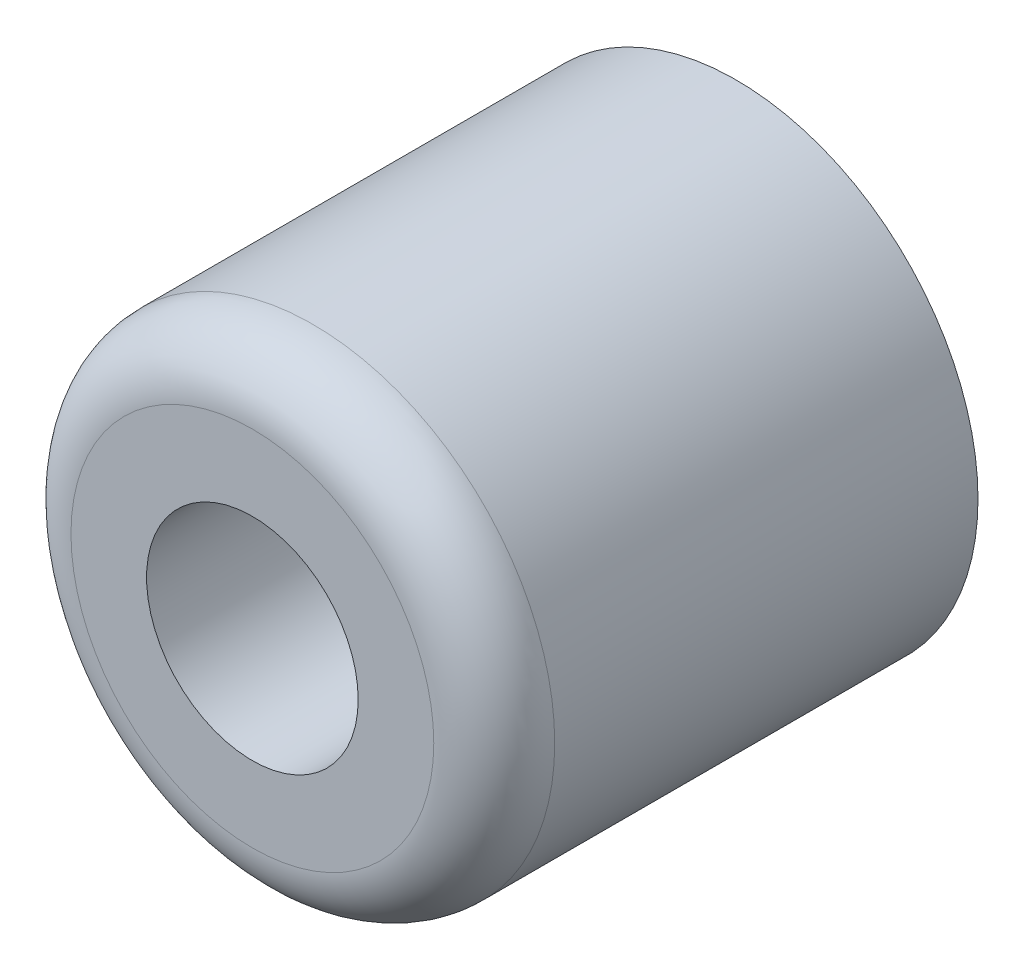
ISO-10303-21;
HEADER;
FILE_DESCRIPTION(('STEP AP214'),'2;1');
FILE_NAME('part.step','',(''),(''),'','','');
FILE_SCHEMA(('AUTOMOTIVE_DESIGN { 1 0 10303 214 1 1 1 1 }'));
ENDSEC;
DATA;
#1=APPLICATION_CONTEXT('core data for automotive mechanical design processes');
#2=APPLICATION_PROTOCOL_DEFINITION('international standard','automotive_design',2000,#1);
#3=PRODUCT_CONTEXT('',#1,'mechanical');
#4=PRODUCT('Part','Part','',(#3));
#5=PRODUCT_RELATED_PRODUCT_CATEGORY('part','',(#4));
#6=PRODUCT_DEFINITION_FORMATION('','',#4);
#7=PRODUCT_DEFINITION_CONTEXT('part definition',#1,'design');
#8=PRODUCT_DEFINITION('design','',#6,#7);
#9=PRODUCT_DEFINITION_SHAPE('','',#8);
#10=(LENGTH_UNIT() NAMED_UNIT(*) SI_UNIT(.MILLI.,.METRE.));
#11=(NAMED_UNIT(*) PLANE_ANGLE_UNIT() SI_UNIT($,.RADIAN.));
#12=(NAMED_UNIT(*) SI_UNIT($,.STERADIAN.) SOLID_ANGLE_UNIT());
#13=UNCERTAINTY_MEASURE_WITH_UNIT(LENGTH_MEASURE(1.E-05),#10,'distance_accuracy_value','');
#14=(GEOMETRIC_REPRESENTATION_CONTEXT(3) GLOBAL_UNCERTAINTY_ASSIGNED_CONTEXT((#13)) GLOBAL_UNIT_ASSIGNED_CONTEXT((#10,
#11,#12)) REPRESENTATION_CONTEXT('',''));
#15=CARTESIAN_POINT('',(0.,0.,0.));
#16=DIRECTION('',(0.,0.,1.));
#17=DIRECTION('',(1.,0.,0.));
#18=AXIS2_PLACEMENT_3D('',#15,#16,#17);
#19=CARTESIAN_POINT('',(0.,0.,25.4));
#20=DIRECTION('',(0.,0.,-1.));
#21=DIRECTION('',(-1.,0.,0.));
#22=AXIS2_PLACEMENT_3D('',#19,#20,#21);
#23=CYLINDRICAL_SURFACE('',#22,3.571875);
#24=CARTESIAN_POINT('',(0.,0.,0.));
#25=DIRECTION('',(0.,0.,1.));
#26=DIRECTION('',(1.,0.,0.));
#27=AXIS2_PLACEMENT_3D('',#24,#25,#26);
#28=CIRCLE('',#27,3.571875);
#29=CARTESIAN_POINT('',(3.571875,0.,0.));
#30=VERTEX_POINT('',#29);
#31=EDGE_CURVE('E48',#30,#30,#28,.T.);
#32=ORIENTED_EDGE('',*,*,#31,.F.);
#33=EDGE_LOOP('',(#32));
#34=FACE_BOUND('',#33,.T.);
#35=CARTESIAN_POINT('',(0.,0.,12.7));
#36=DIRECTION('',(0.,0.,1.));
#37=DIRECTION('',(1.,0.,0.));
#38=AXIS2_PLACEMENT_3D('',#35,#36,#37);
#39=CIRCLE('',#38,3.571875);
#40=CARTESIAN_POINT('',(3.571875,0.,12.7));
#41=VERTEX_POINT('',#40);
#42=EDGE_CURVE('E51',#41,#41,#39,.T.);
#43=ORIENTED_EDGE('',*,*,#42,.T.);
#44=EDGE_LOOP('',(#43));
#45=FACE_BOUND('',#44,.T.);
#46=ADVANCED_FACE('F33',(#34,#45),#23,.F.);
#47=CARTESIAN_POINT('',(0.,0.,25.4));
#48=DIRECTION('',(0.,0.,1.));
#49=DIRECTION('',(1.,0.,0.));
#50=AXIS2_PLACEMENT_3D('',#47,#48,#49);
#51=PLANE('',#50);
#52=CARTESIAN_POINT('',(0.,0.,25.4));
#53=DIRECTION('',(0.,0.,1.));
#54=DIRECTION('',(1.,0.,0.));
#55=AXIS2_PLACEMENT_3D('',#52,#53,#54);
#56=CIRCLE('',#55,9.525);
#57=CARTESIAN_POINT('',(9.525,0.,25.4));
#58=VERTEX_POINT('',#57);
#59=EDGE_CURVE('E40',#58,#58,#56,.T.);
#60=ORIENTED_EDGE('',*,*,#59,.T.);
#61=EDGE_LOOP('',(#60));
#62=FACE_BOUND('',#61,.T.);
#63=CARTESIAN_POINT('',(0.,0.,25.4));
#64=DIRECTION('',(0.,0.,1.));
#65=DIRECTION('',(1.,0.,0.));
#66=AXIS2_PLACEMENT_3D('',#63,#64,#65);
#67=CIRCLE('',#66,5.55625);
#68=CARTESIAN_POINT('',(5.55625,0.,25.4));
#69=VERTEX_POINT('',#68);
#70=EDGE_CURVE('E57',#69,#69,#67,.T.);
#71=ORIENTED_EDGE('',*,*,#70,.F.);
#72=EDGE_LOOP('',(#71));
#73=FACE_BOUND('',#72,.T.);
#74=ADVANCED_FACE('F72',(#62,#73),#51,.T.);
#75=CARTESIAN_POINT('',(0.,0.,0.));
#76=DIRECTION('',(0.,0.,1.));
#77=DIRECTION('',(1.,0.,0.));
#78=AXIS2_PLACEMENT_3D('',#75,#76,#77);
#79=PLANE('',#78);
#80=CARTESIAN_POINT('',(0.,0.,0.));
#81=DIRECTION('',(0.,0.,1.));
#82=DIRECTION('',(1.,0.,0.));
#83=AXIS2_PLACEMENT_3D('',#80,#81,#82);
#84=CIRCLE('',#83,12.7);
#85=CARTESIAN_POINT('',(12.7,0.,0.));
#86=VERTEX_POINT('',#85);
#87=EDGE_CURVE('E44',#86,#86,#84,.T.);
#88=ORIENTED_EDGE('',*,*,#87,.F.);
#89=EDGE_LOOP('',(#88));
#90=FACE_BOUND('',#89,.T.);
#91=ORIENTED_EDGE('',*,*,#31,.T.);
#92=EDGE_LOOP('',(#91));
#93=FACE_BOUND('',#92,.T.);
#94=ADVANCED_FACE('F74',(#90,#93),#79,.F.);
#95=CARTESIAN_POINT('',(0.,0.,25.4));
#96=DIRECTION('',(0.,0.,-1.));
#97=DIRECTION('',(-1.,0.,0.));
#98=AXIS2_PLACEMENT_3D('',#95,#96,#97);
#99=CYLINDRICAL_SURFACE('',#98,12.7);
#100=CARTESIAN_POINT('',(0.,0.,22.225));
#101=DIRECTION('',(0.,0.,1.));
#102=DIRECTION('',(1.,0.,0.));
#103=AXIS2_PLACEMENT_3D('',#100,#101,#102);
#104=CIRCLE('',#103,12.7);
#105=CARTESIAN_POINT('',(12.7,0.,22.225));
#106=VERTEX_POINT('',#105);
#107=EDGE_CURVE('E10',#106,#106,#104,.F.);
#108=ORIENTED_EDGE('',*,*,#107,.T.);
#109=EDGE_LOOP('',(#108));
#110=FACE_BOUND('',#109,.T.);
#111=ORIENTED_EDGE('',*,*,#87,.T.);
#112=EDGE_LOOP('',(#111));
#113=FACE_BOUND('',#112,.T.);
#114=ADVANCED_FACE('F68',(#110,#113),#99,.T.);
#115=CARTESIAN_POINT('',(0.,0.,12.7));
#116=DIRECTION('',(0.,0.,1.));
#117=DIRECTION('',(1.,0.,0.));
#118=AXIS2_PLACEMENT_3D('',#115,#116,#117);
#119=CYLINDRICAL_SURFACE('',#118,5.55625);
#120=CARTESIAN_POINT('',(0.,0.,12.7));
#121=DIRECTION('',(0.,0.,1.));
#122=DIRECTION('',(1.,0.,0.));
#123=AXIS2_PLACEMENT_3D('',#120,#121,#122);
#124=CIRCLE('',#123,5.55625);
#125=CARTESIAN_POINT('',(5.55625,0.,12.7));
#126=VERTEX_POINT('',#125);
#127=EDGE_CURVE('E53',#126,#126,#124,.T.);
#128=ORIENTED_EDGE('',*,*,#127,.F.);
#129=EDGE_LOOP('',(#128));
#130=FACE_BOUND('',#129,.T.);
#131=ORIENTED_EDGE('',*,*,#70,.T.);
#132=EDGE_LOOP('',(#131));
#133=FACE_BOUND('',#132,.T.);
#134=ADVANCED_FACE('F65',(#130,#133),#119,.F.);
#135=CARTESIAN_POINT('',(0.,0.,12.7));
#136=DIRECTION('',(0.,0.,1.));
#137=DIRECTION('',(1.,0.,0.));
#138=AXIS2_PLACEMENT_3D('',#135,#136,#137);
#139=PLANE('',#138);
#140=ORIENTED_EDGE('',*,*,#42,.F.);
#141=EDGE_LOOP('',(#140));
#142=FACE_BOUND('',#141,.T.);
#143=ORIENTED_EDGE('',*,*,#127,.T.);
#144=EDGE_LOOP('',(#143));
#145=FACE_BOUND('',#144,.T.);
#146=ADVANCED_FACE('F63',(#142,#145),#139,.T.);
#147=CARTESIAN_POINT('',(0.,0.,22.225));
#148=DIRECTION('',(0.,0.,1.));
#149=DIRECTION('',(1.,0.,0.));
#150=AXIS2_PLACEMENT_3D('',#147,#148,#149);
#151=TOROIDAL_SURFACE('',#150,9.525,3.175);
#152=ORIENTED_EDGE('',*,*,#107,.F.);
#153=EDGE_LOOP('',(#152));
#154=FACE_BOUND('',#153,.T.);
#155=ORIENTED_EDGE('',*,*,#59,.F.);
#156=EDGE_LOOP('',(#155));
#157=FACE_BOUND('',#156,.T.);
#158=ADVANCED_FACE('F35',(#154,#157),#151,.T.);
#159=CLOSED_SHELL('',(#46,#74,#94,#114,#134,#146,#158));
#160=MANIFOLD_SOLID_BREP('B2',#159);
#161=ADVANCED_BREP_SHAPE_REPRESENTATION('',(#18,#160),#14);
#162=SHAPE_DEFINITION_REPRESENTATION(#9,#161);
ENDSEC;
END-ISO-10303-21;
